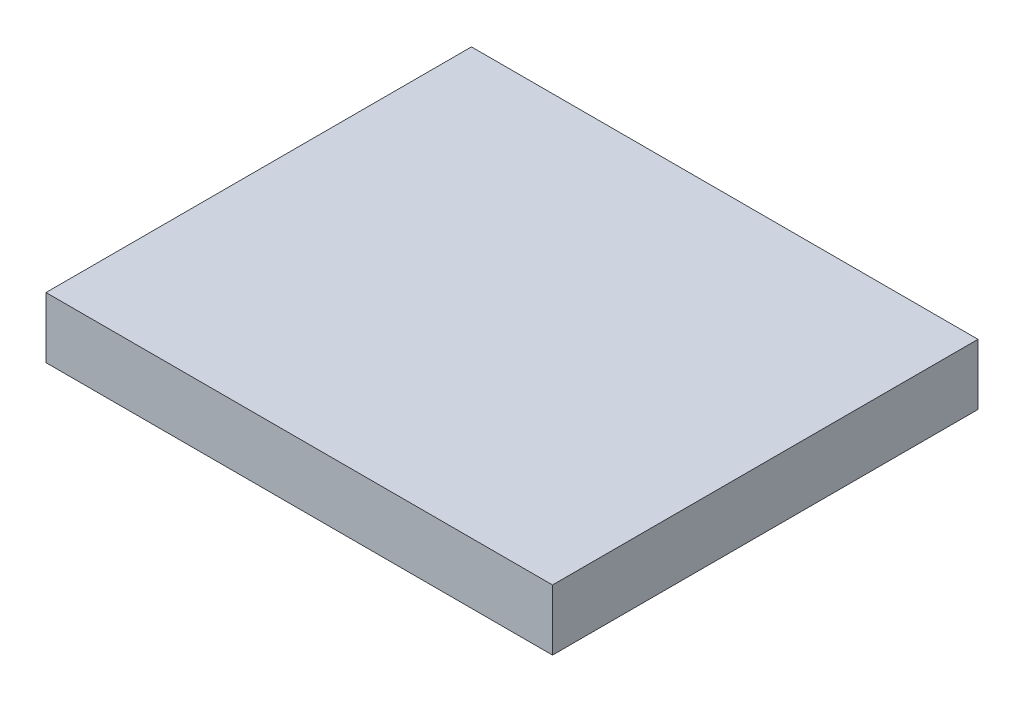
ISO-10303-21;
HEADER;
FILE_DESCRIPTION(('STEP AP214'),'2;1');
FILE_NAME('part.step','',(''),(''),'','','');
FILE_SCHEMA(('AUTOMOTIVE_DESIGN { 1 0 10303 214 1 1 1 1 }'));
ENDSEC;
DATA;
#1=APPLICATION_CONTEXT('core data for automotive mechanical design processes');
#2=APPLICATION_PROTOCOL_DEFINITION('international standard','automotive_design',2000,#1);
#3=PRODUCT_CONTEXT('',#1,'mechanical');
#4=PRODUCT('Part','Part','',(#3));
#5=PRODUCT_RELATED_PRODUCT_CATEGORY('part','',(#4));
#6=PRODUCT_DEFINITION_FORMATION('','',#4);
#7=PRODUCT_DEFINITION_CONTEXT('part definition',#1,'design');
#8=PRODUCT_DEFINITION('design','',#6,#7);
#9=PRODUCT_DEFINITION_SHAPE('','',#8);
#10=(LENGTH_UNIT() NAMED_UNIT(*) SI_UNIT(.MILLI.,.METRE.));
#11=(NAMED_UNIT(*) PLANE_ANGLE_UNIT() SI_UNIT($,.RADIAN.));
#12=(NAMED_UNIT(*) SI_UNIT($,.STERADIAN.) SOLID_ANGLE_UNIT());
#13=UNCERTAINTY_MEASURE_WITH_UNIT(LENGTH_MEASURE(1.E-05),#10,'distance_accuracy_value','');
#14=(GEOMETRIC_REPRESENTATION_CONTEXT(3) GLOBAL_UNCERTAINTY_ASSIGNED_CONTEXT((#13)) GLOBAL_UNIT_ASSIGNED_CONTEXT((#10,
#11,#12)) REPRESENTATION_CONTEXT('',''));
#15=CARTESIAN_POINT('',(0.,0.,0.));
#16=DIRECTION('',(0.,0.,1.));
#17=DIRECTION('',(1.,0.,0.));
#18=AXIS2_PLACEMENT_3D('',#15,#16,#17);
#19=CARTESIAN_POINT('',(19.84375,4.7625,16.66875));
#20=DIRECTION('',(-1.,0.,0.));
#21=DIRECTION('',(0.,0.,1.));
#22=AXIS2_PLACEMENT_3D('',#19,#20,#21);
#23=PLANE('',#22);
#24=DIRECTION('',(0.,0.,-1.));
#25=VECTOR('',#24,1.);
#26=CARTESIAN_POINT('',(19.84375,0.,16.66875));
#27=LINE('',#26,#25);
#28=CARTESIAN_POINT('',(19.84375,0.,16.66875));
#29=VERTEX_POINT('',#28);
#30=CARTESIAN_POINT('',(19.84375,0.,-16.66875));
#31=VERTEX_POINT('',#30);
#32=EDGE_CURVE('E96',#29,#31,#27,.T.);
#33=ORIENTED_EDGE('',*,*,#32,.T.);
#34=DIRECTION('',(0.,-1.,0.));
#35=VECTOR('',#34,1.);
#36=CARTESIAN_POINT('',(19.84375,4.7625,-16.66875));
#37=LINE('',#36,#35);
#38=CARTESIAN_POINT('',(19.84375,4.7625,-16.66875));
#39=VERTEX_POINT('',#38);
#40=EDGE_CURVE('E11',#39,#31,#37,.T.);
#41=ORIENTED_EDGE('',*,*,#40,.F.);
#42=DIRECTION('',(0.,0.,-1.));
#43=VECTOR('',#42,1.);
#44=CARTESIAN_POINT('',(19.84375,4.7625,16.66875));
#45=LINE('',#44,#43);
#46=CARTESIAN_POINT('',(19.84375,4.7625,16.66875));
#47=VERTEX_POINT('',#46);
#48=EDGE_CURVE('E84',#47,#39,#45,.T.);
#49=ORIENTED_EDGE('',*,*,#48,.F.);
#50=DIRECTION('',(0.,-1.,0.));
#51=VECTOR('',#50,1.);
#52=CARTESIAN_POINT('',(19.84375,4.7625,16.66875));
#53=LINE('',#52,#51);
#54=EDGE_CURVE('E92',#47,#29,#53,.T.);
#55=ORIENTED_EDGE('',*,*,#54,.T.);
#56=EDGE_LOOP('',(#33,#41,#49,#55));
#57=FACE_BOUND('',#56,.T.);
#58=ADVANCED_FACE('F33',(#57),#23,.F.);
#59=CARTESIAN_POINT('',(-19.84375,4.7625,-16.66875));
#60=DIRECTION('',(0.,0.,1.));
#61=DIRECTION('',(1.,0.,0.));
#62=AXIS2_PLACEMENT_3D('',#59,#60,#61);
#63=PLANE('',#62);
#64=DIRECTION('',(-1.,0.,0.));
#65=VECTOR('',#64,1.);
#66=CARTESIAN_POINT('',(-19.84375,0.,-16.66875));
#67=LINE('',#66,#65);
#68=CARTESIAN_POINT('',(-19.84375,0.,-16.66875));
#69=VERTEX_POINT('',#68);
#70=EDGE_CURVE('E88',#31,#69,#67,.T.);
#71=ORIENTED_EDGE('',*,*,#70,.T.);
#72=DIRECTION('',(0.,-1.,0.));
#73=VECTOR('',#72,1.);
#74=CARTESIAN_POINT('',(-19.84375,4.7625,-16.66875));
#75=LINE('',#74,#73);
#76=CARTESIAN_POINT('',(-19.84375,4.7625,-16.66875));
#77=VERTEX_POINT('',#76);
#78=EDGE_CURVE('E41',#77,#69,#75,.T.);
#79=ORIENTED_EDGE('',*,*,#78,.F.);
#80=DIRECTION('',(-1.,0.,0.));
#81=VECTOR('',#80,1.);
#82=CARTESIAN_POINT('',(-19.84375,4.7625,-16.66875));
#83=LINE('',#82,#81);
#84=EDGE_CURVE('E79',#39,#77,#83,.T.);
#85=ORIENTED_EDGE('',*,*,#84,.F.);
#86=ORIENTED_EDGE('',*,*,#40,.T.);
#87=EDGE_LOOP('',(#71,#79,#85,#86));
#88=FACE_BOUND('',#87,.T.);
#89=ADVANCED_FACE('F87',(#88),#63,.F.);
#90=CARTESIAN_POINT('',(-19.84375,4.7625,16.66875));
#91=DIRECTION('',(1.,0.,0.));
#92=DIRECTION('',(0.,0.,-1.));
#93=AXIS2_PLACEMENT_3D('',#90,#91,#92);
#94=PLANE('',#93);
#95=DIRECTION('',(0.,0.,1.));
#96=VECTOR('',#95,1.);
#97=CARTESIAN_POINT('',(-19.84375,0.,16.66875));
#98=LINE('',#97,#96);
#99=CARTESIAN_POINT('',(-19.84375,0.,16.66875));
#100=VERTEX_POINT('',#99);
#101=EDGE_CURVE('E66',#69,#100,#98,.T.);
#102=ORIENTED_EDGE('',*,*,#101,.T.);
#103=DIRECTION('',(0.,-1.,0.));
#104=VECTOR('',#103,1.);
#105=CARTESIAN_POINT('',(-19.84375,4.7625,16.66875));
#106=LINE('',#105,#104);
#107=CARTESIAN_POINT('',(-19.84375,4.7625,16.66875));
#108=VERTEX_POINT('',#107);
#109=EDGE_CURVE('E89',#108,#100,#106,.T.);
#110=ORIENTED_EDGE('',*,*,#109,.F.);
#111=DIRECTION('',(0.,0.,1.));
#112=VECTOR('',#111,1.);
#113=CARTESIAN_POINT('',(-19.84375,4.7625,16.66875));
#114=LINE('',#113,#112);
#115=EDGE_CURVE('E82',#77,#108,#114,.T.);
#116=ORIENTED_EDGE('',*,*,#115,.F.);
#117=ORIENTED_EDGE('',*,*,#78,.T.);
#118=EDGE_LOOP('',(#102,#110,#116,#117));
#119=FACE_BOUND('',#118,.T.);
#120=ADVANCED_FACE('F90',(#119),#94,.F.);
#121=CARTESIAN_POINT('',(-19.84375,4.7625,16.66875));
#122=DIRECTION('',(0.,0.,-1.));
#123=DIRECTION('',(-1.,0.,0.));
#124=AXIS2_PLACEMENT_3D('',#121,#122,#123);
#125=PLANE('',#124);
#126=DIRECTION('',(1.,0.,0.));
#127=VECTOR('',#126,1.);
#128=CARTESIAN_POINT('',(-19.84375,0.,16.66875));
#129=LINE('',#128,#127);
#130=EDGE_CURVE('E72',#100,#29,#129,.T.);
#131=ORIENTED_EDGE('',*,*,#130,.T.);
#132=ORIENTED_EDGE('',*,*,#54,.F.);
#133=DIRECTION('',(1.,0.,0.));
#134=VECTOR('',#133,1.);
#135=CARTESIAN_POINT('',(-19.84375,4.7625,16.66875));
#136=LINE('',#135,#134);
#137=EDGE_CURVE('E49',#108,#47,#136,.T.);
#138=ORIENTED_EDGE('',*,*,#137,.F.);
#139=ORIENTED_EDGE('',*,*,#109,.T.);
#140=EDGE_LOOP('',(#131,#132,#138,#139));
#141=FACE_BOUND('',#140,.T.);
#142=ADVANCED_FACE('F103',(#141),#125,.F.);
#143=CARTESIAN_POINT('',(0.,4.7625,0.));
#144=DIRECTION('',(0.,-1.,0.));
#145=DIRECTION('',(0.,0.,-1.));
#146=AXIS2_PLACEMENT_3D('',#143,#144,#145);
#147=PLANE('',#146);
#148=ORIENTED_EDGE('',*,*,#48,.T.);
#149=ORIENTED_EDGE('',*,*,#84,.T.);
#150=ORIENTED_EDGE('',*,*,#115,.T.);
#151=ORIENTED_EDGE('',*,*,#137,.T.);
#152=EDGE_LOOP('',(#148,#149,#150,#151));
#153=FACE_BOUND('',#152,.T.);
#154=ADVANCED_FACE('F80',(#153),#147,.F.);
#155=CARTESIAN_POINT('',(0.,0.,0.));
#156=DIRECTION('',(0.,-1.,0.));
#157=DIRECTION('',(0.,0.,-1.));
#158=AXIS2_PLACEMENT_3D('',#155,#156,#157);
#159=PLANE('',#158);
#160=ORIENTED_EDGE('',*,*,#32,.F.);
#161=ORIENTED_EDGE('',*,*,#130,.F.);
#162=ORIENTED_EDGE('',*,*,#101,.F.);
#163=ORIENTED_EDGE('',*,*,#70,.F.);
#164=EDGE_LOOP('',(#160,#161,#162,#163));
#165=FACE_BOUND('',#164,.T.);
#166=ADVANCED_FACE('F106',(#165),#159,.T.);
#167=CLOSED_SHELL('',(#58,#89,#120,#142,#154,#166));
#168=MANIFOLD_SOLID_BREP('B2',#167);
#169=ADVANCED_BREP_SHAPE_REPRESENTATION('',(#18,#168),#14);
#170=SHAPE_DEFINITION_REPRESENTATION(#9,#169);
ENDSEC;
END-ISO-10303-21;
